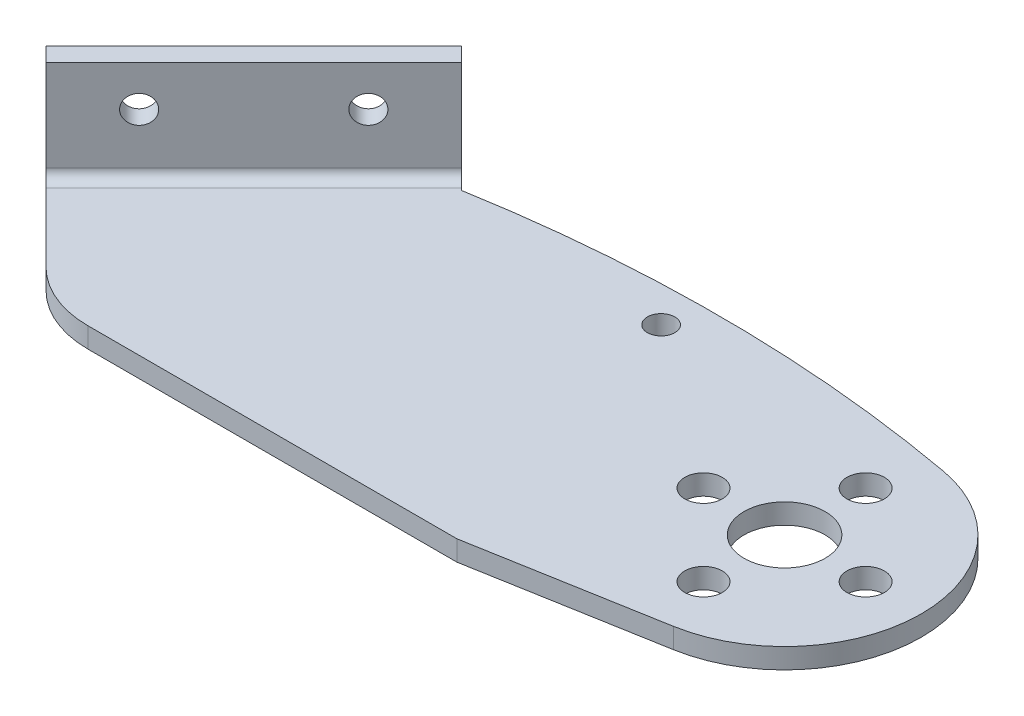
ISO-10303-21;
HEADER;
FILE_DESCRIPTION(('STEP AP214'),'2;1');
FILE_NAME('part.step','',(''),(''),'','','');
FILE_SCHEMA(('AUTOMOTIVE_DESIGN { 1 0 10303 214 1 1 1 1 }'));
ENDSEC;
DATA;
#1=APPLICATION_CONTEXT('core data for automotive mechanical design processes');
#2=APPLICATION_PROTOCOL_DEFINITION('international standard','automotive_design',2000,#1);
#3=PRODUCT_CONTEXT('',#1,'mechanical');
#4=PRODUCT('Part','Part','',(#3));
#5=PRODUCT_RELATED_PRODUCT_CATEGORY('part','',(#4));
#6=PRODUCT_DEFINITION_FORMATION('','',#4);
#7=PRODUCT_DEFINITION_CONTEXT('part definition',#1,'design');
#8=PRODUCT_DEFINITION('design','',#6,#7);
#9=PRODUCT_DEFINITION_SHAPE('','',#8);
#10=(LENGTH_UNIT() NAMED_UNIT(*) SI_UNIT(.MILLI.,.METRE.));
#11=(NAMED_UNIT(*) PLANE_ANGLE_UNIT() SI_UNIT($,.RADIAN.));
#12=(NAMED_UNIT(*) SI_UNIT($,.STERADIAN.) SOLID_ANGLE_UNIT());
#13=UNCERTAINTY_MEASURE_WITH_UNIT(LENGTH_MEASURE(1.E-05),#10,'distance_accuracy_value','');
#14=(GEOMETRIC_REPRESENTATION_CONTEXT(3) GLOBAL_UNCERTAINTY_ASSIGNED_CONTEXT((#13)) GLOBAL_UNIT_ASSIGNED_CONTEXT((#10,
#11,#12)) REPRESENTATION_CONTEXT('',''));
#15=CARTESIAN_POINT('',(0.,0.,0.));
#16=DIRECTION('',(0.,0.,1.));
#17=DIRECTION('',(1.,0.,0.));
#18=AXIS2_PLACEMENT_3D('',#15,#16,#17);
#19=CARTESIAN_POINT('',(13.7940246351911,8.,-9.12741699796952));
#20=DIRECTION('',(-0.707106781186548,0.,-0.707106781186547));
#21=DIRECTION('',(-0.707106781186548,0.,0.707106781186548));
#22=AXIS2_PLACEMENT_3D('',#19,#20,#21);
#23=CYLINDRICAL_SURFACE('',#22,1.36525);
#24=CARTESIAN_POINT('',(11.6727042916315,8.,-11.2487373415292));
#25=DIRECTION('',(-0.707106781186548,0.,-0.707106781186547));
#26=DIRECTION('',(-0.707106781186548,0.,0.707106781186548));
#27=AXIS2_PLACEMENT_3D('',#24,#25,#26);
#28=CIRCLE('',#27,1.36525);
#29=CARTESIAN_POINT('',(10.7073267586166,8.,-10.2833598085142));
#30=VERTEX_POINT('',#29);
#31=EDGE_CURVE('E166',#30,#30,#28,.T.);
#32=ORIENTED_EDGE('',*,*,#31,.T.);
#33=EDGE_LOOP('',(#32));
#34=FACE_BOUND('',#33,.T.);
#35=CARTESIAN_POINT('',(13.0869178540046,8.,-9.83452377915606));
#36=DIRECTION('',(-0.707106781186548,0.,-0.707106781186548));
#37=DIRECTION('',(-0.707106781186548,0.,0.707106781186548));
#38=AXIS2_PLACEMENT_3D('',#35,#36,#37);
#39=CIRCLE('',#38,1.36525);
#40=CARTESIAN_POINT('',(12.1215403209897,8.,-8.86914624614113));
#41=VERTEX_POINT('',#40);
#42=EDGE_CURVE('E217',#41,#41,#39,.T.);
#43=ORIENTED_EDGE('',*,*,#42,.F.);
#44=EDGE_LOOP('',(#43));
#45=FACE_BOUND('',#44,.T.);
#46=ADVANCED_FACE('F39',(#34,#45),#23,.F.);
#47=CARTESIAN_POINT('',(2.48031613620638,8.,2.18629150101524));
#48=DIRECTION('',(-0.707106781186548,0.,-0.707106781186547));
#49=DIRECTION('',(-0.707106781186548,0.,0.707106781186548));
#50=AXIS2_PLACEMENT_3D('',#47,#48,#49);
#51=CYLINDRICAL_SURFACE('',#50,1.36525);
#52=CARTESIAN_POINT('',(0.358995792646737,8.,0.0649711574556003));
#53=DIRECTION('',(-0.707106781186548,0.,-0.707106781186547));
#54=DIRECTION('',(-0.707106781186548,0.,0.707106781186548));
#55=AXIS2_PLACEMENT_3D('',#52,#53,#54);
#56=CIRCLE('',#55,1.36525);
#57=CARTESIAN_POINT('',(-0.606381740368197,8.,1.03034869047053));
#58=VERTEX_POINT('',#57);
#59=EDGE_CURVE('E236',#58,#58,#56,.T.);
#60=ORIENTED_EDGE('',*,*,#59,.T.);
#61=EDGE_LOOP('',(#60));
#62=FACE_BOUND('',#61,.T.);
#63=CARTESIAN_POINT('',(1.77320935501983,8.,1.4791847198287));
#64=DIRECTION('',(-0.707106781186548,0.,-0.707106781186548));
#65=DIRECTION('',(-0.707106781186548,0.,0.707106781186548));
#66=AXIS2_PLACEMENT_3D('',#63,#64,#65);
#67=CIRCLE('',#66,1.36525);
#68=CARTESIAN_POINT('',(0.8078318220049,8.,2.44456225284363));
#69=VERTEX_POINT('',#68);
#70=EDGE_CURVE('E222',#69,#69,#67,.T.);
#71=ORIENTED_EDGE('',*,*,#70,.F.);
#72=EDGE_LOOP('',(#71));
#73=FACE_BOUND('',#72,.T.);
#74=ADVANCED_FACE('F255',(#62,#73),#51,.F.);
#75=CARTESIAN_POINT('',(70.0090137395217,12.,37.8951839509359));
#76=DIRECTION('',(0.,1.,0.));
#77=DIRECTION('',(-0.707106781186548,0.,0.707106781186548));
#78=AXIS2_PLACEMENT_3D('',#75,#76,#77);
#79=PLANE('',#78);
#80=DIRECTION('',(-0.707106781186548,0.,-0.707106781186548));
#81=VECTOR('',#80,1.);
#82=CARTESIAN_POINT('',(70.0090137395217,12.,37.8951839509359));
#83=LINE('',#82,#81);
#84=CARTESIAN_POINT('',(17.6831119317172,12.,-14.4307178568686));
#85=VERTEX_POINT('',#84);
#86=CARTESIAN_POINT('',(16.2688983693441,12.,-15.8449314192417));
#87=VERTEX_POINT('',#86);
#88=EDGE_CURVE('E234',#85,#87,#83,.T.);
#89=ORIENTED_EDGE('',*,*,#88,.T.);
#90=DIRECTION('',(-0.707106781186547,0.,0.707106781186547));
#91=VECTOR('',#90,1.);
#92=CARTESIAN_POINT('',(16.2688983693441,12.,-15.8449314192417));
#93=LINE('',#92,#91);
#94=CARTESIAN_POINT('',(-4.23719828506582,12.,4.66116523516816));
#95=VERTEX_POINT('',#94);
#96=EDGE_CURVE('E147',#87,#95,#93,.T.);
#97=ORIENTED_EDGE('',*,*,#96,.T.);
#98=DIRECTION('',(-0.707106781186548,0.,-0.707106781186548));
#99=VECTOR('',#98,1.);
#100=CARTESIAN_POINT('',(49.5029170851118,12.,58.4012806053458));
#101=LINE('',#100,#99);
#102=CARTESIAN_POINT('',(-2.82298472269272,12.,6.07537879754126));
#103=VERTEX_POINT('',#102);
#104=EDGE_CURVE('E225',#103,#95,#101,.T.);
#105=ORIENTED_EDGE('',*,*,#104,.F.);
#106=DIRECTION('',(0.707106781186547,0.,-0.707106781186547));
#107=VECTOR('',#106,1.);
#108=CARTESIAN_POINT('',(17.6831119317172,12.,-14.4307178568686));
#109=LINE('',#108,#107);
#110=EDGE_CURVE('E58',#103,#85,#109,.T.);
#111=ORIENTED_EDGE('',*,*,#110,.T.);
#112=EDGE_LOOP('',(#89,#97,#105,#111));
#113=FACE_BOUND('',#112,.T.);
#114=ADVANCED_FACE('F252',(#113),#79,.T.);
#115=CARTESIAN_POINT('',(70.0090137395217,12.,37.8951839509359));
#116=DIRECTION('',(0.707106781186548,0.,-0.707106781186548));
#117=DIRECTION('',(0.,1.,0.));
#118=AXIS2_PLACEMENT_3D('',#115,#116,#117);
#119=PLANE('',#118);
#120=DIRECTION('',(-0.707106781186548,0.,-0.707106781186548));
#121=VECTOR('',#120,1.);
#122=CARTESIAN_POINT('',(70.0090137395217,3.,37.8951839509359));
#123=LINE('',#122,#121);
#124=CARTESIAN_POINT('',(17.6831119317172,2.99999999999999,-14.4307178568686));
#125=VERTEX_POINT('',#124);
#126=CARTESIAN_POINT('',(16.2688983693441,2.99999999999998,-15.8449314192417));
#127=VERTEX_POINT('',#126);
#128=EDGE_CURVE('E149',#125,#127,#123,.T.);
#129=ORIENTED_EDGE('',*,*,#128,.T.);
#130=DIRECTION('',(0.,1.,0.));
#131=VECTOR('',#130,1.);
#132=CARTESIAN_POINT('',(16.2688983693441,0.,-15.8449314192417));
#133=LINE('',#132,#131);
#134=EDGE_CURVE('E83',#127,#87,#133,.T.);
#135=ORIENTED_EDGE('',*,*,#134,.T.);
#136=ORIENTED_EDGE('',*,*,#88,.F.);
#137=DIRECTION('',(0.,-1.,0.));
#138=VECTOR('',#137,1.);
#139=CARTESIAN_POINT('',(17.6831119317172,12.,-14.4307178568686));
#140=LINE('',#139,#138);
#141=EDGE_CURVE('E148',#85,#125,#140,.T.);
#142=ORIENTED_EDGE('',*,*,#141,.T.);
#143=EDGE_LOOP('',(#129,#135,#136,#142));
#144=FACE_BOUND('',#143,.T.);
#145=ADVANCED_FACE('F153',(#144),#119,.T.);
#146=CARTESIAN_POINT('',(16.2688983693441,0.,-15.8449314192417));
#147=DIRECTION('',(-0.707106781186547,0.,-0.707106781186548));
#148=DIRECTION('',(-0.707106781186548,0.,0.707106781186548));
#149=AXIS2_PLACEMENT_3D('',#146,#147,#148);
#150=PLANE('',#149);
#151=DIRECTION('',(0.707106781186548,0.,-0.707106781186547));
#152=VECTOR('',#151,1.);
#153=CARTESIAN_POINT('',(16.2688983693441,3.,-15.8449314192417));
#154=LINE('',#153,#152);
#155=CARTESIAN_POINT('',(-4.23719828506582,3.,4.66116523516816));
#156=VERTEX_POINT('',#155);
#157=EDGE_CURVE('E77',#156,#127,#154,.T.);
#158=ORIENTED_EDGE('',*,*,#157,.F.);
#159=DIRECTION('',(0.,1.,0.));
#160=VECTOR('',#159,1.);
#161=CARTESIAN_POINT('',(-4.23719828506582,12.,4.66116523516816));
#162=LINE('',#161,#160);
#163=EDGE_CURVE('E227',#156,#95,#162,.T.);
#164=ORIENTED_EDGE('',*,*,#163,.T.);
#165=ORIENTED_EDGE('',*,*,#96,.F.);
#166=ORIENTED_EDGE('',*,*,#134,.F.);
#167=EDGE_LOOP('',(#158,#164,#165,#166));
#168=FACE_BOUND('',#167,.T.);
#169=ORIENTED_EDGE('',*,*,#59,.F.);
#170=EDGE_LOOP('',(#169));
#171=FACE_BOUND('',#170,.T.);
#172=ORIENTED_EDGE('',*,*,#31,.F.);
#173=EDGE_LOOP('',(#172));
#174=FACE_BOUND('',#173,.T.);
#175=ADVANCED_FACE('F144',(#168,#171,#174),#150,.T.);
#176=CARTESIAN_POINT('',(49.5029170851118,12.,58.4012806053458));
#177=DIRECTION('',(0.707106781186548,0.,-0.707106781186548));
#178=DIRECTION('',(0.,1.,0.));
#179=AXIS2_PLACEMENT_3D('',#176,#177,#178);
#180=PLANE('',#179);
#181=ORIENTED_EDGE('',*,*,#163,.F.);
#182=DIRECTION('',(-0.707106781186548,0.,-0.707106781186548));
#183=VECTOR('',#182,1.);
#184=CARTESIAN_POINT('',(49.5029170851118,3.,58.4012806053458));
#185=LINE('',#184,#183);
#186=CARTESIAN_POINT('',(-2.82298472269272,3.,6.07537879754126));
#187=VERTEX_POINT('',#186);
#188=EDGE_CURVE('E43',#187,#156,#185,.T.);
#189=ORIENTED_EDGE('',*,*,#188,.F.);
#190=DIRECTION('',(0.,-1.,0.));
#191=VECTOR('',#190,1.);
#192=CARTESIAN_POINT('',(-2.82298472269272,12.,6.07537879754126));
#193=LINE('',#192,#191);
#194=EDGE_CURVE('E49',#103,#187,#193,.T.);
#195=ORIENTED_EDGE('',*,*,#194,.F.);
#196=ORIENTED_EDGE('',*,*,#104,.T.);
#197=EDGE_LOOP('',(#181,#189,#195,#196));
#198=FACE_BOUND('',#197,.T.);
#199=ADVANCED_FACE('F245',(#198),#180,.F.);
#200=CARTESIAN_POINT('',(17.6831119317172,12.,-14.4307178568686));
#201=DIRECTION('',(-0.707106781186548,0.,-0.707106781186548));
#202=DIRECTION('',(-0.707106781186548,0.,0.707106781186548));
#203=AXIS2_PLACEMENT_3D('',#200,#201,#202);
#204=PLANE('',#203);
#205=ORIENTED_EDGE('',*,*,#70,.T.);
#206=EDGE_LOOP('',(#205));
#207=FACE_BOUND('',#206,.T.);
#208=ORIENTED_EDGE('',*,*,#42,.T.);
#209=EDGE_LOOP('',(#208));
#210=FACE_BOUND('',#209,.T.);
#211=ORIENTED_EDGE('',*,*,#194,.T.);
#212=DIRECTION('',(0.707106781186548,0.,-0.707106781186548));
#213=VECTOR('',#212,1.);
#214=CARTESIAN_POINT('',(17.6831119317172,3.,-14.4307178568686));
#215=LINE('',#214,#213);
#216=EDGE_CURVE('E11',#187,#125,#215,.T.);
#217=ORIENTED_EDGE('',*,*,#216,.T.);
#218=ORIENTED_EDGE('',*,*,#141,.F.);
#219=ORIENTED_EDGE('',*,*,#110,.F.);
#220=EDGE_LOOP('',(#211,#217,#218,#219));
#221=FACE_BOUND('',#220,.T.);
#222=ADVANCED_FACE('F41',(#207,#210,#221),#204,.F.);
#223=CARTESIAN_POINT('',(64.,0.,0.));
#224=DIRECTION('',(0.,1.,0.));
#225=DIRECTION('',(0.,0.,1.));
#226=AXIS2_PLACEMENT_3D('',#223,#224,#225);
#227=PLANE('',#226);
#228=CARTESIAN_POINT('',(56.,0.,0.));
#229=DIRECTION('',(0.,1.,0.));
#230=DIRECTION('',(0.,0.,-1.));
#231=AXIS2_PLACEMENT_3D('',#228,#229,#230);
#232=CIRCLE('',#231,1.85);
#233=CARTESIAN_POINT('',(56.,0.,-1.85));
#234=VERTEX_POINT('',#233);
#235=EDGE_CURVE('E354',#234,#234,#232,.T.);
#236=ORIENTED_EDGE('',*,*,#235,.T.);
#237=EDGE_LOOP('',(#236));
#238=FACE_BOUND('',#237,.T.);
#239=CARTESIAN_POINT('',(64.,0.,8.));
#240=DIRECTION('',(0.,1.,0.));
#241=DIRECTION('',(0.,0.,-1.));
#242=AXIS2_PLACEMENT_3D('',#239,#240,#241);
#243=CIRCLE('',#242,1.85);
#244=CARTESIAN_POINT('',(64.,0.,6.15));
#245=VERTEX_POINT('',#244);
#246=EDGE_CURVE('E351',#245,#245,#243,.T.);
#247=ORIENTED_EDGE('',*,*,#246,.T.);
#248=EDGE_LOOP('',(#247));
#249=FACE_BOUND('',#248,.T.);
#250=CARTESIAN_POINT('',(72.,0.,0.));
#251=DIRECTION('',(0.,1.,0.));
#252=DIRECTION('',(0.,0.,-1.));
#253=AXIS2_PLACEMENT_3D('',#250,#251,#252);
#254=CIRCLE('',#253,1.85);
#255=CARTESIAN_POINT('',(72.,0.,-1.85));
#256=VERTEX_POINT('',#255);
#257=EDGE_CURVE('E348',#256,#256,#254,.T.);
#258=ORIENTED_EDGE('',*,*,#257,.T.);
#259=EDGE_LOOP('',(#258));
#260=FACE_BOUND('',#259,.T.);
#261=CARTESIAN_POINT('',(64.,0.,-8.));
#262=DIRECTION('',(0.,1.,0.));
#263=DIRECTION('',(0.,0.,-1.));
#264=AXIS2_PLACEMENT_3D('',#261,#262,#263);
#265=CIRCLE('',#264,1.85);
#266=CARTESIAN_POINT('',(64.,0.,-9.85));
#267=VERTEX_POINT('',#266);
#268=EDGE_CURVE('E345',#267,#267,#265,.T.);
#269=ORIENTED_EDGE('',*,*,#268,.T.);
#270=EDGE_LOOP('',(#269));
#271=FACE_BOUND('',#270,.T.);
#272=CARTESIAN_POINT('',(64.,0.,0.));
#273=DIRECTION('',(0.,1.,0.));
#274=DIRECTION('',(0.,0.,-1.));
#275=AXIS2_PLACEMENT_3D('',#272,#273,#274);
#276=CIRCLE('',#275,4.);
#277=CARTESIAN_POINT('',(64.,0.,-4.));
#278=VERTEX_POINT('',#277);
#279=EDGE_CURVE('E342',#278,#278,#276,.T.);
#280=ORIENTED_EDGE('',*,*,#279,.T.);
#281=EDGE_LOOP('',(#280));
#282=FACE_BOUND('',#281,.T.);
#283=CARTESIAN_POINT('',(39.9467553839433,0.,-11.8675875071896));
#284=DIRECTION('',(0.,1.,0.));
#285=DIRECTION('',(0.,0.,1.));
#286=AXIS2_PLACEMENT_3D('',#283,#284,#285);
#287=CIRCLE('',#286,1.35255);
#288=CARTESIAN_POINT('',(39.9467553839433,0.,-10.5150375071896));
#289=VERTEX_POINT('',#288);
#290=EDGE_CURVE('E339',#289,#289,#287,.T.);
#291=ORIENTED_EDGE('',*,*,#290,.T.);
#292=EDGE_LOOP('',(#291));
#293=FACE_BOUND('',#292,.T.);
#294=DIRECTION('',(-0.707106781186548,0.,0.707106781186548));
#295=VECTOR('',#294,1.);
#296=CARTESIAN_POINT('',(18.3902187129037,0.,-13.7236110756821));
#297=LINE('',#296,#295);
#298=CARTESIAN_POINT('',(18.3902187129037,0.,-13.7236110756821));
#299=VERTEX_POINT('',#298);
#300=CARTESIAN_POINT('',(-2.11587794150619,0.,6.78248557872778));
#301=VERTEX_POINT('',#300);
#302=EDGE_CURVE('E194',#299,#301,#297,.T.);
#303=ORIENTED_EDGE('',*,*,#302,.F.);
#304=DIRECTION('',(-0.707106781186547,0.,-0.707106781186548));
#305=VECTOR('',#304,1.);
#306=CARTESIAN_POINT('',(18.6138297885858,0.,-13.5));
#307=LINE('',#306,#305);
#308=CARTESIAN_POINT('',(18.6138297885858,0.,-13.5));
#309=VERTEX_POINT('',#308);
#310=EDGE_CURVE('E292',#309,#299,#307,.T.);
#311=ORIENTED_EDGE('',*,*,#310,.F.);
#312=CARTESIAN_POINT('',(41.9018097680888,0.,121.082502881433));
#313=DIRECTION('',(0.,1.,0.));
#314=DIRECTION('',(0.,0.,-1.));
#315=AXIS2_PLACEMENT_3D('',#312,#313,#314);
#316=CIRCLE('',#315,136.582502881433);
#317=CARTESIAN_POINT('',(66.423785356544,0.,-13.2806349451148));
#318=VERTEX_POINT('',#317);
#319=EDGE_CURVE('E295',#318,#309,#316,.T.);
#320=ORIENTED_EDGE('',*,*,#319,.F.);
#321=CARTESIAN_POINT('',(64.,0.,0.));
#322=DIRECTION('',(0.,1.,0.));
#323=DIRECTION('',(0.,0.,1.));
#324=AXIS2_PLACEMENT_3D('',#321,#322,#323);
#325=CIRCLE('',#324,13.5);
#326=CARTESIAN_POINT('',(66.3442503985036,0.,13.2949046656648));
#327=VERTEX_POINT('',#326);
#328=EDGE_CURVE('E298',#327,#318,#325,.T.);
#329=ORIENTED_EDGE('',*,*,#328,.F.);
#330=DIRECTION('',(0.984807753012208,0.,-0.173648177666931));
#331=VECTOR('',#330,1.);
#332=CARTESIAN_POINT('',(48.167251498747,0.,16.5));
#333=LINE('',#332,#331);
#334=CARTESIAN_POINT('',(48.167251498747,0.,16.5));
#335=VERTEX_POINT('',#334);
#336=EDGE_CURVE('E189',#335,#327,#333,.T.);
#337=ORIENTED_EDGE('',*,*,#336,.F.);
#338=DIRECTION('',(1.,0.,0.));
#339=VECTOR('',#338,1.);
#340=CARTESIAN_POINT('',(7.60163647976604,0.,16.5));
#341=LINE('',#340,#339);
#342=CARTESIAN_POINT('',(11.743772103497,0.,16.5));
#343=VERTEX_POINT('',#342);
#344=EDGE_CURVE('E357',#343,#335,#341,.T.);
#345=ORIENTED_EDGE('',*,*,#344,.F.);
#346=CARTESIAN_POINT('',(11.743772103497,0.,6.5));
#347=DIRECTION('',(0.,1.,0.));
#348=DIRECTION('',(0.,0.,1.));
#349=AXIS2_PLACEMENT_3D('',#346,#347,#348);
#350=CIRCLE('',#349,10.);
#351=CARTESIAN_POINT('',(4.67270429163152,0.,13.5710678118655));
#352=VERTEX_POINT('',#351);
#353=EDGE_CURVE('E300',#343,#352,#350,.F.);
#354=ORIENTED_EDGE('',*,*,#353,.T.);
#355=DIRECTION('',(0.707106781186548,0.,0.707106781186547));
#356=VECTOR('',#355,1.);
#357=CARTESIAN_POINT('',(-4.23719828506582,0.,4.66116523516815));
#358=LINE('',#357,#356);
#359=EDGE_CURVE('E296',#301,#352,#358,.T.);
#360=ORIENTED_EDGE('',*,*,#359,.F.);
#361=EDGE_LOOP('',(#303,#311,#320,#329,#337,#345,#354,#360));
#362=FACE_BOUND('',#361,.T.);
#363=ADVANCED_FACE('F360',(#238,#249,#260,#271,#282,#293,#362),#227,.F.);
#364=CARTESIAN_POINT('',(64.,2.,0.));
#365=DIRECTION('',(0.,1.,0.));
#366=DIRECTION('',(0.,0.,1.));
#367=AXIS2_PLACEMENT_3D('',#364,#365,#366);
#368=PLANE('',#367);
#369=CARTESIAN_POINT('',(39.9467553839433,2.,-11.8675875071896));
#370=DIRECTION('',(0.,1.,0.));
#371=DIRECTION('',(0.,0.,1.));
#372=AXIS2_PLACEMENT_3D('',#369,#370,#371);
#373=CIRCLE('',#372,1.35255);
#374=CARTESIAN_POINT('',(39.9467553839433,2.,-10.5150375071896));
#375=VERTEX_POINT('',#374);
#376=EDGE_CURVE('E172',#375,#375,#373,.F.);
#377=ORIENTED_EDGE('',*,*,#376,.T.);
#378=EDGE_LOOP('',(#377));
#379=FACE_BOUND('',#378,.T.);
#380=CARTESIAN_POINT('',(64.,2.,0.));
#381=DIRECTION('',(0.,1.,0.));
#382=DIRECTION('',(0.,0.,-1.));
#383=AXIS2_PLACEMENT_3D('',#380,#381,#382);
#384=CIRCLE('',#383,4.);
#385=CARTESIAN_POINT('',(64.,2.,-4.));
#386=VERTEX_POINT('',#385);
#387=EDGE_CURVE('E322',#386,#386,#384,.T.);
#388=ORIENTED_EDGE('',*,*,#387,.F.);
#389=EDGE_LOOP('',(#388));
#390=FACE_BOUND('',#389,.T.);
#391=CARTESIAN_POINT('',(64.,2.,-8.));
#392=DIRECTION('',(0.,1.,0.));
#393=DIRECTION('',(0.,0.,-1.));
#394=AXIS2_PLACEMENT_3D('',#391,#392,#393);
#395=CIRCLE('',#394,1.85);
#396=CARTESIAN_POINT('',(64.,2.,-9.85));
#397=VERTEX_POINT('',#396);
#398=EDGE_CURVE('E327',#397,#397,#395,.T.);
#399=ORIENTED_EDGE('',*,*,#398,.F.);
#400=EDGE_LOOP('',(#399));
#401=FACE_BOUND('',#400,.T.);
#402=CARTESIAN_POINT('',(72.,2.,0.));
#403=DIRECTION('',(0.,1.,0.));
#404=DIRECTION('',(0.,0.,-1.));
#405=AXIS2_PLACEMENT_3D('',#402,#403,#404);
#406=CIRCLE('',#405,1.85);
#407=CARTESIAN_POINT('',(72.,2.,-1.85));
#408=VERTEX_POINT('',#407);
#409=EDGE_CURVE('E330',#408,#408,#406,.T.);
#410=ORIENTED_EDGE('',*,*,#409,.F.);
#411=EDGE_LOOP('',(#410));
#412=FACE_BOUND('',#411,.T.);
#413=CARTESIAN_POINT('',(64.,2.,8.));
#414=DIRECTION('',(0.,1.,0.));
#415=DIRECTION('',(0.,0.,-1.));
#416=AXIS2_PLACEMENT_3D('',#413,#414,#415);
#417=CIRCLE('',#416,1.85);
#418=CARTESIAN_POINT('',(64.,2.,6.15));
#419=VERTEX_POINT('',#418);
#420=EDGE_CURVE('E333',#419,#419,#417,.T.);
#421=ORIENTED_EDGE('',*,*,#420,.F.);
#422=EDGE_LOOP('',(#421));
#423=FACE_BOUND('',#422,.T.);
#424=CARTESIAN_POINT('',(56.,2.,0.));
#425=DIRECTION('',(0.,1.,0.));
#426=DIRECTION('',(0.,0.,-1.));
#427=AXIS2_PLACEMENT_3D('',#424,#425,#426);
#428=CIRCLE('',#427,1.85);
#429=CARTESIAN_POINT('',(56.,2.,-1.85));
#430=VERTEX_POINT('',#429);
#431=EDGE_CURVE('E336',#430,#430,#428,.T.);
#432=ORIENTED_EDGE('',*,*,#431,.F.);
#433=EDGE_LOOP('',(#432));
#434=FACE_BOUND('',#433,.T.);
#435=DIRECTION('',(-0.707106781186547,0.,-0.707106781186548));
#436=VECTOR('',#435,1.);
#437=CARTESIAN_POINT('',(18.6138297885858,2.,-13.5));
#438=LINE('',#437,#436);
#439=CARTESIAN_POINT('',(18.6138297885858,2.,-13.5));
#440=VERTEX_POINT('',#439);
#441=CARTESIAN_POINT('',(18.3902187129037,2.,-13.7236110756821));
#442=VERTEX_POINT('',#441);
#443=EDGE_CURVE('E289',#440,#442,#438,.T.);
#444=ORIENTED_EDGE('',*,*,#443,.T.);
#445=DIRECTION('',(-0.707106781186548,0.,0.707106781186548));
#446=VECTOR('',#445,1.);
#447=CARTESIAN_POINT('',(18.3902187129037,2.,-13.7236110756821));
#448=LINE('',#447,#446);
#449=CARTESIAN_POINT('',(-2.11587794150617,2.,6.78248557872779));
#450=VERTEX_POINT('',#449);
#451=EDGE_CURVE('E191',#442,#450,#448,.T.);
#452=ORIENTED_EDGE('',*,*,#451,.T.);
#453=DIRECTION('',(0.707106781186548,0.,0.707106781186547));
#454=VECTOR('',#453,1.);
#455=CARTESIAN_POINT('',(-4.23719828506582,2.,4.66116523516815));
#456=LINE('',#455,#454);
#457=CARTESIAN_POINT('',(4.67270429163152,2.,13.5710678118655));
#458=VERTEX_POINT('',#457);
#459=EDGE_CURVE('E181',#450,#458,#456,.T.);
#460=ORIENTED_EDGE('',*,*,#459,.T.);
#461=CARTESIAN_POINT('',(11.743772103497,2.,6.5));
#462=DIRECTION('',(0.,1.,0.));
#463=DIRECTION('',(0.,0.,1.));
#464=AXIS2_PLACEMENT_3D('',#461,#462,#463);
#465=CIRCLE('',#464,10.);
#466=CARTESIAN_POINT('',(11.743772103497,2.,16.5));
#467=VERTEX_POINT('',#466);
#468=EDGE_CURVE('E91',#458,#467,#465,.T.);
#469=ORIENTED_EDGE('',*,*,#468,.T.);
#470=DIRECTION('',(1.,0.,0.));
#471=VECTOR('',#470,1.);
#472=CARTESIAN_POINT('',(7.60163647976604,2.,16.5));
#473=LINE('',#472,#471);
#474=CARTESIAN_POINT('',(48.167251498747,2.,16.5));
#475=VERTEX_POINT('',#474);
#476=EDGE_CURVE('E99',#467,#475,#473,.T.);
#477=ORIENTED_EDGE('',*,*,#476,.T.);
#478=DIRECTION('',(0.984807753012208,0.,-0.173648177666931));
#479=VECTOR('',#478,1.);
#480=CARTESIAN_POINT('',(48.167251498747,2.,16.5));
#481=LINE('',#480,#479);
#482=CARTESIAN_POINT('',(66.3442503985036,2.,13.2949046656648));
#483=VERTEX_POINT('',#482);
#484=EDGE_CURVE('E316',#475,#483,#481,.T.);
#485=ORIENTED_EDGE('',*,*,#484,.T.);
#486=CARTESIAN_POINT('',(64.,2.,0.));
#487=DIRECTION('',(0.,1.,0.));
#488=DIRECTION('',(0.,0.,1.));
#489=AXIS2_PLACEMENT_3D('',#486,#487,#488);
#490=CIRCLE('',#489,13.5);
#491=CARTESIAN_POINT('',(66.423785356544,2.,-13.2806349451148));
#492=VERTEX_POINT('',#491);
#493=EDGE_CURVE('E314',#483,#492,#490,.T.);
#494=ORIENTED_EDGE('',*,*,#493,.T.);
#495=CARTESIAN_POINT('',(41.9018097680888,2.,121.082502881433));
#496=DIRECTION('',(0.,1.,0.));
#497=DIRECTION('',(0.,0.,-1.));
#498=AXIS2_PLACEMENT_3D('',#495,#496,#497);
#499=CIRCLE('',#498,136.582502881433);
#500=EDGE_CURVE('E315',#492,#440,#499,.T.);
#501=ORIENTED_EDGE('',*,*,#500,.T.);
#502=EDGE_LOOP('',(#444,#452,#460,#469,#477,#485,#494,#501));
#503=FACE_BOUND('',#502,.T.);
#504=ADVANCED_FACE('F286',(#379,#390,#401,#412,#423,#434,#503),#368,.T.);
#505=CARTESIAN_POINT('',(56.,0.,0.));
#506=DIRECTION('',(0.,1.,0.));
#507=DIRECTION('',(0.,0.,1.));
#508=AXIS2_PLACEMENT_3D('',#505,#506,#507);
#509=CYLINDRICAL_SURFACE('',#508,1.85);
#510=ORIENTED_EDGE('',*,*,#235,.F.);
#511=EDGE_LOOP('',(#510));
#512=FACE_BOUND('',#511,.T.);
#513=ORIENTED_EDGE('',*,*,#431,.T.);
#514=EDGE_LOOP('',(#513));
#515=FACE_BOUND('',#514,.T.);
#516=ADVANCED_FACE('F379',(#512,#515),#509,.F.);
#517=CARTESIAN_POINT('',(64.,0.,8.));
#518=DIRECTION('',(0.,1.,0.));
#519=DIRECTION('',(0.,0.,1.));
#520=AXIS2_PLACEMENT_3D('',#517,#518,#519);
#521=CYLINDRICAL_SURFACE('',#520,1.85);
#522=ORIENTED_EDGE('',*,*,#246,.F.);
#523=EDGE_LOOP('',(#522));
#524=FACE_BOUND('',#523,.T.);
#525=ORIENTED_EDGE('',*,*,#420,.T.);
#526=EDGE_LOOP('',(#525));
#527=FACE_BOUND('',#526,.T.);
#528=ADVANCED_FACE('F382',(#524,#527),#521,.F.);
#529=CARTESIAN_POINT('',(72.,0.,0.));
#530=DIRECTION('',(0.,1.,0.));
#531=DIRECTION('',(0.,0.,1.));
#532=AXIS2_PLACEMENT_3D('',#529,#530,#531);
#533=CYLINDRICAL_SURFACE('',#532,1.85);
#534=ORIENTED_EDGE('',*,*,#257,.F.);
#535=EDGE_LOOP('',(#534));
#536=FACE_BOUND('',#535,.T.);
#537=ORIENTED_EDGE('',*,*,#409,.T.);
#538=EDGE_LOOP('',(#537));
#539=FACE_BOUND('',#538,.T.);
#540=ADVANCED_FACE('F386',(#536,#539),#533,.F.);
#541=CARTESIAN_POINT('',(64.,0.,-8.));
#542=DIRECTION('',(0.,1.,0.));
#543=DIRECTION('',(0.,0.,1.));
#544=AXIS2_PLACEMENT_3D('',#541,#542,#543);
#545=CYLINDRICAL_SURFACE('',#544,1.85);
#546=ORIENTED_EDGE('',*,*,#268,.F.);
#547=EDGE_LOOP('',(#546));
#548=FACE_BOUND('',#547,.T.);
#549=ORIENTED_EDGE('',*,*,#398,.T.);
#550=EDGE_LOOP('',(#549));
#551=FACE_BOUND('',#550,.T.);
#552=ADVANCED_FACE('F390',(#548,#551),#545,.F.);
#553=CARTESIAN_POINT('',(64.,0.,0.));
#554=DIRECTION('',(0.,1.,0.));
#555=DIRECTION('',(0.,0.,1.));
#556=AXIS2_PLACEMENT_3D('',#553,#554,#555);
#557=CYLINDRICAL_SURFACE('',#556,4.);
#558=ORIENTED_EDGE('',*,*,#279,.F.);
#559=EDGE_LOOP('',(#558));
#560=FACE_BOUND('',#559,.T.);
#561=ORIENTED_EDGE('',*,*,#387,.T.);
#562=EDGE_LOOP('',(#561));
#563=FACE_BOUND('',#562,.T.);
#564=ADVANCED_FACE('F394',(#560,#563),#557,.F.);
#565=CARTESIAN_POINT('',(39.9467553839433,6.,-11.8675875071896));
#566=DIRECTION('',(0.,-1.,0.));
#567=DIRECTION('',(0.,0.,-1.));
#568=AXIS2_PLACEMENT_3D('',#565,#566,#567);
#569=CYLINDRICAL_SURFACE('',#568,1.35255);
#570=ORIENTED_EDGE('',*,*,#376,.F.);
#571=EDGE_LOOP('',(#570));
#572=FACE_BOUND('',#571,.T.);
#573=ORIENTED_EDGE('',*,*,#290,.F.);
#574=EDGE_LOOP('',(#573));
#575=FACE_BOUND('',#574,.T.);
#576=ADVANCED_FACE('F398',(#572,#575),#569,.F.);
#577=CARTESIAN_POINT('',(18.6138297885858,171.612214255242,-13.5));
#578=DIRECTION('',(-0.707106781186548,0.,0.707106781186547));
#579=DIRECTION('',(0.707106781186547,0.,0.707106781186548));
#580=AXIS2_PLACEMENT_3D('',#577,#578,#579);
#581=PLANE('',#580);
#582=DIRECTION('',(0.,-1.,0.));
#583=VECTOR('',#582,1.);
#584=CARTESIAN_POINT('',(18.6138297885858,171.612214255242,-13.5));
#585=LINE('',#584,#583);
#586=EDGE_CURVE('E196',#440,#309,#585,.T.);
#587=ORIENTED_EDGE('',*,*,#586,.T.);
#588=ORIENTED_EDGE('',*,*,#310,.T.);
#589=DIRECTION('',(0.,-1.,0.));
#590=VECTOR('',#589,1.);
#591=CARTESIAN_POINT('',(18.3902187129037,171.612214255242,-13.7236110756821));
#592=LINE('',#591,#590);
#593=EDGE_CURVE('E169',#442,#299,#592,.T.);
#594=ORIENTED_EDGE('',*,*,#593,.F.);
#595=ORIENTED_EDGE('',*,*,#443,.F.);
#596=EDGE_LOOP('',(#587,#588,#594,#595));
#597=FACE_BOUND('',#596,.T.);
#598=ADVANCED_FACE('F263',(#597),#581,.F.);
#599=CARTESIAN_POINT('',(-4.23719828506582,171.612214255242,4.66116523516815));
#600=DIRECTION('',(0.707106781186547,0.,-0.707106781186548));
#601=DIRECTION('',(-0.707106781186548,0.,-0.707106781186547));
#602=AXIS2_PLACEMENT_3D('',#599,#600,#601);
#603=PLANE('',#602);
#604=DIRECTION('',(0.,-1.,0.));
#605=VECTOR('',#604,1.);
#606=CARTESIAN_POINT('',(-2.11587794150617,171.612214255242,6.78248557872779));
#607=LINE('',#606,#605);
#608=EDGE_CURVE('E212',#450,#301,#607,.T.);
#609=ORIENTED_EDGE('',*,*,#608,.T.);
#610=ORIENTED_EDGE('',*,*,#359,.T.);
#611=DIRECTION('',(0.,-1.,0.));
#612=VECTOR('',#611,1.);
#613=CARTESIAN_POINT('',(4.67270429163152,171.612214255242,13.5710678118655));
#614=LINE('',#613,#612);
#615=EDGE_CURVE('E210',#458,#352,#614,.T.);
#616=ORIENTED_EDGE('',*,*,#615,.F.);
#617=ORIENTED_EDGE('',*,*,#459,.F.);
#618=EDGE_LOOP('',(#609,#610,#616,#617));
#619=FACE_BOUND('',#618,.T.);
#620=ADVANCED_FACE('F283',(#619),#603,.F.);
#621=CARTESIAN_POINT('',(11.743772103497,171.612214255242,6.5));
#622=DIRECTION('',(0.,-1.,0.));
#623=DIRECTION('',(0.,0.,-1.));
#624=AXIS2_PLACEMENT_3D('',#621,#622,#623);
#625=CYLINDRICAL_SURFACE('',#624,10.);
#626=ORIENTED_EDGE('',*,*,#615,.T.);
#627=ORIENTED_EDGE('',*,*,#353,.F.);
#628=DIRECTION('',(0.,-1.,0.));
#629=VECTOR('',#628,1.);
#630=CARTESIAN_POINT('',(11.743772103497,171.612214255242,16.5));
#631=LINE('',#630,#629);
#632=EDGE_CURVE('E208',#467,#343,#631,.T.);
#633=ORIENTED_EDGE('',*,*,#632,.F.);
#634=ORIENTED_EDGE('',*,*,#468,.F.);
#635=EDGE_LOOP('',(#626,#627,#633,#634));
#636=FACE_BOUND('',#635,.T.);
#637=ADVANCED_FACE('F361',(#636),#625,.T.);
#638=CARTESIAN_POINT('',(7.60163647976604,171.612214255242,16.5));
#639=DIRECTION('',(0.,0.,-1.));
#640=DIRECTION('',(-1.,0.,0.));
#641=AXIS2_PLACEMENT_3D('',#638,#639,#640);
#642=PLANE('',#641);
#643=ORIENTED_EDGE('',*,*,#632,.T.);
#644=ORIENTED_EDGE('',*,*,#344,.T.);
#645=DIRECTION('',(0.,-1.,0.));
#646=VECTOR('',#645,1.);
#647=CARTESIAN_POINT('',(48.167251498747,171.612214255242,16.5));
#648=LINE('',#647,#646);
#649=EDGE_CURVE('E205',#475,#335,#648,.T.);
#650=ORIENTED_EDGE('',*,*,#649,.F.);
#651=ORIENTED_EDGE('',*,*,#476,.F.);
#652=EDGE_LOOP('',(#643,#644,#650,#651));
#653=FACE_BOUND('',#652,.T.);
#654=ADVANCED_FACE('F363',(#653),#642,.F.);
#655=CARTESIAN_POINT('',(48.167251498747,171.612214255242,16.5));
#656=DIRECTION('',(-0.173648177666931,0.,-0.984807753012208));
#657=DIRECTION('',(-0.984807753012208,0.,0.173648177666931));
#658=AXIS2_PLACEMENT_3D('',#655,#656,#657);
#659=PLANE('',#658);
#660=ORIENTED_EDGE('',*,*,#649,.T.);
#661=ORIENTED_EDGE('',*,*,#336,.T.);
#662=DIRECTION('',(0.,-1.,0.));
#663=VECTOR('',#662,1.);
#664=CARTESIAN_POINT('',(66.3442503985036,171.612214255242,13.2949046656648));
#665=LINE('',#664,#663);
#666=EDGE_CURVE('E202',#483,#327,#665,.T.);
#667=ORIENTED_EDGE('',*,*,#666,.F.);
#668=ORIENTED_EDGE('',*,*,#484,.F.);
#669=EDGE_LOOP('',(#660,#661,#667,#668));
#670=FACE_BOUND('',#669,.T.);
#671=ADVANCED_FACE('F309',(#670),#659,.F.);
#672=CARTESIAN_POINT('',(64.,171.612214255242,0.));
#673=DIRECTION('',(0.,-1.,0.));
#674=DIRECTION('',(0.,0.,-1.));
#675=AXIS2_PLACEMENT_3D('',#672,#673,#674);
#676=CYLINDRICAL_SURFACE('',#675,13.5);
#677=ORIENTED_EDGE('',*,*,#666,.T.);
#678=ORIENTED_EDGE('',*,*,#328,.T.);
#679=DIRECTION('',(0.,-1.,0.));
#680=VECTOR('',#679,1.);
#681=CARTESIAN_POINT('',(66.423785356544,171.612214255242,-13.2806349451148));
#682=LINE('',#681,#680);
#683=EDGE_CURVE('E199',#492,#318,#682,.T.);
#684=ORIENTED_EDGE('',*,*,#683,.F.);
#685=ORIENTED_EDGE('',*,*,#493,.F.);
#686=EDGE_LOOP('',(#677,#678,#684,#685));
#687=FACE_BOUND('',#686,.T.);
#688=ADVANCED_FACE('F312',(#687),#676,.T.);
#689=CARTESIAN_POINT('',(41.9018097680888,171.612214255242,121.082502881433));
#690=DIRECTION('',(0.,-1.,0.));
#691=DIRECTION('',(0.,0.,-1.));
#692=AXIS2_PLACEMENT_3D('',#689,#690,#691);
#693=CYLINDRICAL_SURFACE('',#692,136.582502881433);
#694=ORIENTED_EDGE('',*,*,#683,.T.);
#695=ORIENTED_EDGE('',*,*,#319,.T.);
#696=ORIENTED_EDGE('',*,*,#586,.F.);
#697=ORIENTED_EDGE('',*,*,#500,.F.);
#698=EDGE_LOOP('',(#694,#695,#696,#697));
#699=FACE_BOUND('',#698,.T.);
#700=ADVANCED_FACE('F375',(#699),#693,.T.);
#701=CARTESIAN_POINT('',(-2.11587794150618,3.,6.78248557872782));
#702=DIRECTION('',(-0.707106781186547,0.,0.707106781186549));
#703=DIRECTION('',(0.707106781186549,0.,0.707106781186547));
#704=AXIS2_PLACEMENT_3D('',#701,#702,#703);
#705=PLANE('',#704);
#706=ORIENTED_EDGE('',*,*,#608,.F.);
#707=CARTESIAN_POINT('',(-2.11587794150617,3.,6.78248557872781));
#708=DIRECTION('',(-0.707106781186547,0.,0.707106781186547));
#709=DIRECTION('',(0.707106781186548,0.,0.707106781186548));
#710=AXIS2_PLACEMENT_3D('',#707,#708,#709);
#711=CIRCLE('',#710,1.);
#712=EDGE_CURVE('E170',#450,#187,#711,.F.);
#713=ORIENTED_EDGE('',*,*,#712,.T.);
#714=ORIENTED_EDGE('',*,*,#188,.T.);
#715=CARTESIAN_POINT('',(-2.11587794150617,3.,6.78248557872781));
#716=DIRECTION('',(-0.707106781186547,0.,0.707106781186547));
#717=DIRECTION('',(0.707106781186548,0.,0.707106781186548));
#718=AXIS2_PLACEMENT_3D('',#715,#716,#717);
#719=CIRCLE('',#718,3.);
#720=EDGE_CURVE('E165',#301,#156,#719,.F.);
#721=ORIENTED_EDGE('',*,*,#720,.F.);
#722=EDGE_LOOP('',(#706,#713,#714,#721));
#723=FACE_BOUND('',#722,.T.);
#724=ADVANCED_FACE('F279',(#723),#705,.T.);
#725=CARTESIAN_POINT('',(18.3902187129037,3.,-13.7236110756821));
#726=DIRECTION('',(0.707106781186548,0.,-0.707106781186547));
#727=DIRECTION('',(-0.707106781186547,0.,-0.707106781186548));
#728=AXIS2_PLACEMENT_3D('',#725,#726,#727);
#729=PLANE('',#728);
#730=ORIENTED_EDGE('',*,*,#128,.F.);
#731=CARTESIAN_POINT('',(18.3902187129037,3.,-13.7236110756821));
#732=DIRECTION('',(-0.707106781186547,0.,0.707106781186547));
#733=DIRECTION('',(0.707106781186548,0.,0.707106781186548));
#734=AXIS2_PLACEMENT_3D('',#731,#732,#733);
#735=CIRCLE('',#734,1.);
#736=EDGE_CURVE('E175',#125,#442,#735,.T.);
#737=ORIENTED_EDGE('',*,*,#736,.T.);
#738=ORIENTED_EDGE('',*,*,#593,.T.);
#739=CARTESIAN_POINT('',(18.3902187129037,3.,-13.7236110756821));
#740=DIRECTION('',(-0.707106781186547,0.,0.707106781186547));
#741=DIRECTION('',(0.707106781186548,0.,0.707106781186548));
#742=AXIS2_PLACEMENT_3D('',#739,#740,#741);
#743=CIRCLE('',#742,3.);
#744=EDGE_CURVE('E163',#127,#299,#743,.T.);
#745=ORIENTED_EDGE('',*,*,#744,.F.);
#746=EDGE_LOOP('',(#730,#737,#738,#745));
#747=FACE_BOUND('',#746,.T.);
#748=ADVANCED_FACE('F167',(#747),#729,.T.);
#749=CARTESIAN_POINT('',(86.2533087872125,3.,-81.5867011499908));
#750=DIRECTION('',(-0.707106781186547,0.,0.707106781186547));
#751=DIRECTION('',(0.707106781186548,0.,0.707106781186548));
#752=AXIS2_PLACEMENT_3D('',#749,#750,#751);
#753=CYLINDRICAL_SURFACE('',#752,3.);
#754=ORIENTED_EDGE('',*,*,#744,.T.);
#755=ORIENTED_EDGE('',*,*,#302,.T.);
#756=ORIENTED_EDGE('',*,*,#720,.T.);
#757=ORIENTED_EDGE('',*,*,#157,.T.);
#758=EDGE_LOOP('',(#754,#755,#756,#757));
#759=FACE_BOUND('',#758,.T.);
#760=ADVANCED_FACE('F161',(#759),#753,.T.);
#761=CARTESIAN_POINT('',(86.2533087872125,3.,-81.5867011499908));
#762=DIRECTION('',(-0.707106781186547,0.,0.707106781186547));
#763=DIRECTION('',(0.707106781186548,0.,0.707106781186548));
#764=AXIS2_PLACEMENT_3D('',#761,#762,#763);
#765=CYLINDRICAL_SURFACE('',#764,1.);
#766=ORIENTED_EDGE('',*,*,#736,.F.);
#767=ORIENTED_EDGE('',*,*,#216,.F.);
#768=ORIENTED_EDGE('',*,*,#712,.F.);
#769=ORIENTED_EDGE('',*,*,#451,.F.);
#770=EDGE_LOOP('',(#766,#767,#768,#769));
#771=FACE_BOUND('',#770,.T.);
#772=ADVANCED_FACE('F275',(#771),#765,.F.);
#773=CLOSED_SHELL('',(#46,#74,#114,#145,#175,#199,#222,#363,#504,#516,#528,#540,#552,#564,#576,
#598,#620,#637,#654,#671,#688,#700,#724,#748,#760,#772));
#774=MANIFOLD_SOLID_BREP('B2',#773);
#775=ADVANCED_BREP_SHAPE_REPRESENTATION('',(#18,#774),#14);
#776=SHAPE_DEFINITION_REPRESENTATION(#9,#775);
ENDSEC;
END-ISO-10303-21;
